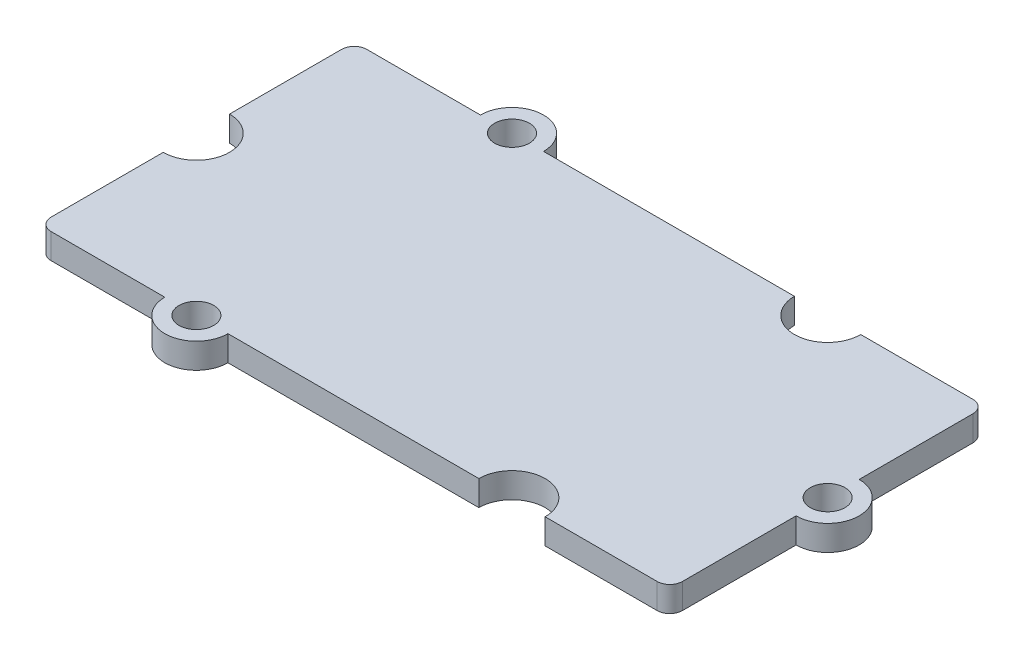
ISO-10303-21;
HEADER;
FILE_DESCRIPTION(('STEP AP214'),'2;1');
FILE_NAME('part.step','',(''),(''),'','','');
FILE_SCHEMA(('AUTOMOTIVE_DESIGN { 1 0 10303 214 1 1 1 1 }'));
ENDSEC;
DATA;
#1=APPLICATION_CONTEXT('core data for automotive mechanical design processes');
#2=APPLICATION_PROTOCOL_DEFINITION('international standard','automotive_design',2000,#1);
#3=PRODUCT_CONTEXT('',#1,'mechanical');
#4=PRODUCT('Part','Part','',(#3));
#5=PRODUCT_RELATED_PRODUCT_CATEGORY('part','',(#4));
#6=PRODUCT_DEFINITION_FORMATION('','',#4);
#7=PRODUCT_DEFINITION_CONTEXT('part definition',#1,'design');
#8=PRODUCT_DEFINITION('design','',#6,#7);
#9=PRODUCT_DEFINITION_SHAPE('','',#8);
#10=(LENGTH_UNIT() NAMED_UNIT(*) SI_UNIT(.MILLI.,.METRE.));
#11=(NAMED_UNIT(*) PLANE_ANGLE_UNIT() SI_UNIT($,.RADIAN.));
#12=(NAMED_UNIT(*) SI_UNIT($,.STERADIAN.) SOLID_ANGLE_UNIT());
#13=UNCERTAINTY_MEASURE_WITH_UNIT(LENGTH_MEASURE(1.E-05),#10,'distance_accuracy_value','');
#14=(GEOMETRIC_REPRESENTATION_CONTEXT(3) GLOBAL_UNCERTAINTY_ASSIGNED_CONTEXT((#13)) GLOBAL_UNIT_ASSIGNED_CONTEXT((#10,
#11,#12)) REPRESENTATION_CONTEXT('',''));
#15=CARTESIAN_POINT('',(0.,0.,0.));
#16=DIRECTION('',(0.,0.,1.));
#17=DIRECTION('',(1.,0.,0.));
#18=AXIS2_PLACEMENT_3D('',#15,#16,#17);
#19=CARTESIAN_POINT('',(20.,0.8,0.));
#20=DIRECTION('',(0.,-1.,0.));
#21=DIRECTION('',(0.,0.,-1.));
#22=AXIS2_PLACEMENT_3D('',#19,#20,#21);
#23=CYLINDRICAL_SURFACE('',#22,2.);
#24=CARTESIAN_POINT('',(20.,-0.8,0.));
#25=DIRECTION('',(0.,1.,0.));
#26=DIRECTION('',(0.,0.,1.));
#27=AXIS2_PLACEMENT_3D('',#24,#25,#26);
#28=CIRCLE('',#27,2.);
#29=CARTESIAN_POINT('',(20.,-0.8,2.00000000000001));
#30=VERTEX_POINT('',#29);
#31=CARTESIAN_POINT('',(20.,-0.8,-2.));
#32=VERTEX_POINT('',#31);
#33=EDGE_CURVE('E216',#30,#32,#28,.T.);
#34=ORIENTED_EDGE('',*,*,#33,.T.);
#35=DIRECTION('',(0.,-1.,0.));
#36=VECTOR('',#35,1.);
#37=CARTESIAN_POINT('',(20.,0.8,-2.));
#38=LINE('',#37,#36);
#39=CARTESIAN_POINT('',(20.,0.8,-2.));
#40=VERTEX_POINT('',#39);
#41=EDGE_CURVE('E11',#40,#32,#38,.T.);
#42=ORIENTED_EDGE('',*,*,#41,.F.);
#43=CARTESIAN_POINT('',(20.,0.8,0.));
#44=DIRECTION('',(0.,1.,0.));
#45=DIRECTION('',(0.,0.,1.));
#46=AXIS2_PLACEMENT_3D('',#43,#44,#45);
#47=CIRCLE('',#46,2.);
#48=CARTESIAN_POINT('',(20.,0.8,2.00000000000001));
#49=VERTEX_POINT('',#48);
#50=EDGE_CURVE('E267',#49,#40,#47,.T.);
#51=ORIENTED_EDGE('',*,*,#50,.F.);
#52=DIRECTION('',(0.,-1.,0.));
#53=VECTOR('',#52,1.);
#54=CARTESIAN_POINT('',(20.,0.8,2.00000000000001));
#55=LINE('',#54,#53);
#56=EDGE_CURVE('E215',#49,#30,#55,.T.);
#57=ORIENTED_EDGE('',*,*,#56,.T.);
#58=EDGE_LOOP('',(#34,#42,#51,#57));
#59=FACE_BOUND('',#58,.T.);
#60=ADVANCED_FACE('F36',(#59),#23,.T.);
#61=CARTESIAN_POINT('',(20.,0.8,0.));
#62=DIRECTION('',(-1.,0.,0.));
#63=DIRECTION('',(0.,0.,1.));
#64=AXIS2_PLACEMENT_3D('',#61,#62,#63);
#65=PLANE('',#64);
#66=DIRECTION('',(0.,0.,-1.));
#67=VECTOR('',#66,1.);
#68=CARTESIAN_POINT('',(20.,-0.8,0.));
#69=LINE('',#68,#67);
#70=CARTESIAN_POINT('',(20.,-0.8,-9.19999999999999));
#71=VERTEX_POINT('',#70);
#72=EDGE_CURVE('E219',#32,#71,#69,.T.);
#73=ORIENTED_EDGE('',*,*,#72,.T.);
#74=DIRECTION('',(0.,-1.,0.));
#75=VECTOR('',#74,1.);
#76=CARTESIAN_POINT('',(20.,0.8,-9.19999999999999));
#77=LINE('',#76,#75);
#78=CARTESIAN_POINT('',(20.,0.8,-9.19999999999999));
#79=VERTEX_POINT('',#78);
#80=EDGE_CURVE('E44',#79,#71,#77,.T.);
#81=ORIENTED_EDGE('',*,*,#80,.F.);
#82=DIRECTION('',(0.,0.,-1.));
#83=VECTOR('',#82,1.);
#84=CARTESIAN_POINT('',(20.,0.8,0.));
#85=LINE('',#84,#83);
#86=EDGE_CURVE('E131',#40,#79,#85,.T.);
#87=ORIENTED_EDGE('',*,*,#86,.F.);
#88=ORIENTED_EDGE('',*,*,#41,.T.);
#89=EDGE_LOOP('',(#73,#81,#87,#88));
#90=FACE_BOUND('',#89,.T.);
#91=ADVANCED_FACE('F306',(#90),#65,.F.);
#92=CARTESIAN_POINT('',(19.2,0.8,-9.19999999999999));
#93=DIRECTION('',(0.,-1.,0.));
#94=DIRECTION('',(0.,0.,-1.));
#95=AXIS2_PLACEMENT_3D('',#92,#93,#94);
#96=CYLINDRICAL_SURFACE('',#95,0.800000000000002);
#97=CARTESIAN_POINT('',(19.2,-0.8,-9.19999999999999));
#98=DIRECTION('',(0.,1.,0.));
#99=DIRECTION('',(0.,0.,1.));
#100=AXIS2_PLACEMENT_3D('',#97,#98,#99);
#101=CIRCLE('',#100,0.800000000000002);
#102=CARTESIAN_POINT('',(19.2,-0.8,-9.99999999999999));
#103=VERTEX_POINT('',#102);
#104=EDGE_CURVE('E222',#103,#71,#101,.F.);
#105=ORIENTED_EDGE('',*,*,#104,.F.);
#106=DIRECTION('',(0.,-1.,0.));
#107=VECTOR('',#106,1.);
#108=CARTESIAN_POINT('',(19.2,0.8,-9.99999999999999));
#109=LINE('',#108,#107);
#110=CARTESIAN_POINT('',(19.2,0.8,-9.99999999999999));
#111=VERTEX_POINT('',#110);
#112=EDGE_CURVE('E299',#111,#103,#109,.T.);
#113=ORIENTED_EDGE('',*,*,#112,.F.);
#114=CARTESIAN_POINT('',(19.2,0.8,-9.19999999999999));
#115=DIRECTION('',(0.,1.,0.));
#116=DIRECTION('',(0.,0.,1.));
#117=AXIS2_PLACEMENT_3D('',#114,#115,#116);
#118=CIRCLE('',#117,0.800000000000002);
#119=EDGE_CURVE('E305',#111,#79,#118,.F.);
#120=ORIENTED_EDGE('',*,*,#119,.T.);
#121=ORIENTED_EDGE('',*,*,#80,.T.);
#122=EDGE_LOOP('',(#105,#113,#120,#121));
#123=FACE_BOUND('',#122,.T.);
#124=ADVANCED_FACE('F303',(#123),#96,.T.);
#125=CARTESIAN_POINT('',(0.,0.8,-9.99999999999999));
#126=DIRECTION('',(0.,0.,-1.));
#127=DIRECTION('',(-1.,0.,0.));
#128=AXIS2_PLACEMENT_3D('',#125,#126,#127);
#129=PLANE('',#128);
#130=DIRECTION('',(1.,0.,0.));
#131=VECTOR('',#130,1.);
#132=CARTESIAN_POINT('',(0.,-0.8,-9.99999999999999));
#133=LINE('',#132,#131);
#134=CARTESIAN_POINT('',(12.1,-0.8,-9.99999999999999));
#135=VERTEX_POINT('',#134);
#136=EDGE_CURVE('E225',#135,#103,#133,.T.);
#137=ORIENTED_EDGE('',*,*,#136,.F.);
#138=DIRECTION('',(0.,-1.,0.));
#139=VECTOR('',#138,1.);
#140=CARTESIAN_POINT('',(12.1,0.8,-9.99999999999999));
#141=LINE('',#140,#139);
#142=CARTESIAN_POINT('',(12.1,0.8,-9.99999999999999));
#143=VERTEX_POINT('',#142);
#144=EDGE_CURVE('E297',#143,#135,#141,.T.);
#145=ORIENTED_EDGE('',*,*,#144,.F.);
#146=DIRECTION('',(1.,0.,0.));
#147=VECTOR('',#146,1.);
#148=CARTESIAN_POINT('',(0.,0.8,-9.99999999999999));
#149=LINE('',#148,#147);
#150=EDGE_CURVE('E319',#143,#111,#149,.T.);
#151=ORIENTED_EDGE('',*,*,#150,.T.);
#152=ORIENTED_EDGE('',*,*,#112,.T.);
#153=EDGE_LOOP('',(#137,#145,#151,#152));
#154=FACE_BOUND('',#153,.T.);
#155=ADVANCED_FACE('F316',(#154),#129,.T.);
#156=CARTESIAN_POINT('',(10.,0.8,-9.99999999999999));
#157=DIRECTION('',(0.,-1.,0.));
#158=DIRECTION('',(0.,0.,-1.));
#159=AXIS2_PLACEMENT_3D('',#156,#157,#158);
#160=CYLINDRICAL_SURFACE('',#159,2.1);
#161=CARTESIAN_POINT('',(10.,-0.8,-9.99999999999999));
#162=DIRECTION('',(0.,1.,0.));
#163=DIRECTION('',(0.,0.,1.));
#164=AXIS2_PLACEMENT_3D('',#161,#162,#163);
#165=CIRCLE('',#164,2.1);
#166=CARTESIAN_POINT('',(7.9,-0.8,-9.99999999999999));
#167=VERTEX_POINT('',#166);
#168=EDGE_CURVE('E228',#167,#135,#165,.T.);
#169=ORIENTED_EDGE('',*,*,#168,.F.);
#170=DIRECTION('',(0.,-1.,0.));
#171=VECTOR('',#170,1.);
#172=CARTESIAN_POINT('',(7.9,0.8,-9.99999999999999));
#173=LINE('',#172,#171);
#174=CARTESIAN_POINT('',(7.9,0.8,-9.99999999999999));
#175=VERTEX_POINT('',#174);
#176=EDGE_CURVE('E295',#175,#167,#173,.T.);
#177=ORIENTED_EDGE('',*,*,#176,.F.);
#178=CARTESIAN_POINT('',(10.,0.8,-9.99999999999999));
#179=DIRECTION('',(0.,1.,0.));
#180=DIRECTION('',(0.,0.,1.));
#181=AXIS2_PLACEMENT_3D('',#178,#179,#180);
#182=CIRCLE('',#181,2.1);
#183=EDGE_CURVE('E323',#175,#143,#182,.T.);
#184=ORIENTED_EDGE('',*,*,#183,.T.);
#185=ORIENTED_EDGE('',*,*,#144,.T.);
#186=EDGE_LOOP('',(#169,#177,#184,#185));
#187=FACE_BOUND('',#186,.T.);
#188=ADVANCED_FACE('F401',(#187),#160,.F.);
#189=CARTESIAN_POINT('',(-8.,-0.8,-9.99999999999999));
#190=VERTEX_POINT('',#189);
#191=EDGE_CURVE('E230',#190,#167,#133,.T.);
#192=ORIENTED_EDGE('',*,*,#191,.F.);
#193=DIRECTION('',(0.,-1.,0.));
#194=VECTOR('',#193,1.);
#195=CARTESIAN_POINT('',(-8.,0.8,-9.99999999999999));
#196=LINE('',#195,#194);
#197=CARTESIAN_POINT('',(-8.,0.8,-9.99999999999999));
#198=VERTEX_POINT('',#197);
#199=EDGE_CURVE('E293',#198,#190,#196,.T.);
#200=ORIENTED_EDGE('',*,*,#199,.F.);
#201=EDGE_CURVE('E326',#198,#175,#149,.T.);
#202=ORIENTED_EDGE('',*,*,#201,.T.);
#203=ORIENTED_EDGE('',*,*,#176,.T.);
#204=EDGE_LOOP('',(#192,#200,#202,#203));
#205=FACE_BOUND('',#204,.T.);
#206=ADVANCED_FACE('F396',(#205),#129,.T.);
#207=CARTESIAN_POINT('',(-10.,0.8,-9.99999999999999));
#208=DIRECTION('',(0.,-1.,0.));
#209=DIRECTION('',(0.,0.,-1.));
#210=AXIS2_PLACEMENT_3D('',#207,#208,#209);
#211=CYLINDRICAL_SURFACE('',#210,2.);
#212=CARTESIAN_POINT('',(-10.,-0.8,-9.99999999999999));
#213=DIRECTION('',(0.,1.,0.));
#214=DIRECTION('',(0.,0.,1.));
#215=AXIS2_PLACEMENT_3D('',#212,#213,#214);
#216=CIRCLE('',#215,2.);
#217=CARTESIAN_POINT('',(-12.,-0.8,-9.99999999999999));
#218=VERTEX_POINT('',#217);
#219=EDGE_CURVE('E233',#190,#218,#216,.T.);
#220=ORIENTED_EDGE('',*,*,#219,.T.);
#221=DIRECTION('',(0.,-1.,0.));
#222=VECTOR('',#221,1.);
#223=CARTESIAN_POINT('',(-12.,0.8,-9.99999999999999));
#224=LINE('',#223,#222);
#225=CARTESIAN_POINT('',(-12.,0.8,-9.99999999999999));
#226=VERTEX_POINT('',#225);
#227=EDGE_CURVE('E291',#226,#218,#224,.T.);
#228=ORIENTED_EDGE('',*,*,#227,.F.);
#229=CARTESIAN_POINT('',(-10.,0.8,-9.99999999999999));
#230=DIRECTION('',(0.,1.,0.));
#231=DIRECTION('',(0.,0.,1.));
#232=AXIS2_PLACEMENT_3D('',#229,#230,#231);
#233=CIRCLE('',#232,2.);
#234=EDGE_CURVE('E330',#198,#226,#233,.T.);
#235=ORIENTED_EDGE('',*,*,#234,.F.);
#236=ORIENTED_EDGE('',*,*,#199,.T.);
#237=EDGE_LOOP('',(#220,#228,#235,#236));
#238=FACE_BOUND('',#237,.T.);
#239=ADVANCED_FACE('F403',(#238),#211,.T.);
#240=CARTESIAN_POINT('',(-19.2,-0.8,-9.99999999999999));
#241=VERTEX_POINT('',#240);
#242=EDGE_CURVE('E229',#241,#218,#133,.T.);
#243=ORIENTED_EDGE('',*,*,#242,.F.);
#244=DIRECTION('',(0.,-1.,0.));
#245=VECTOR('',#244,1.);
#246=CARTESIAN_POINT('',(-19.2,0.8,-9.99999999999999));
#247=LINE('',#246,#245);
#248=CARTESIAN_POINT('',(-19.2,0.8,-9.99999999999999));
#249=VERTEX_POINT('',#248);
#250=EDGE_CURVE('E289',#249,#241,#247,.T.);
#251=ORIENTED_EDGE('',*,*,#250,.F.);
#252=EDGE_CURVE('E325',#249,#226,#149,.T.);
#253=ORIENTED_EDGE('',*,*,#252,.T.);
#254=ORIENTED_EDGE('',*,*,#227,.T.);
#255=EDGE_LOOP('',(#243,#251,#253,#254));
#256=FACE_BOUND('',#255,.T.);
#257=ADVANCED_FACE('F392',(#256),#129,.T.);
#258=CARTESIAN_POINT('',(-19.2,0.8,-9.19999999999999));
#259=DIRECTION('',(0.,-1.,0.));
#260=DIRECTION('',(0.,0.,-1.));
#261=AXIS2_PLACEMENT_3D('',#258,#259,#260);
#262=CYLINDRICAL_SURFACE('',#261,0.8);
#263=CARTESIAN_POINT('',(-19.2,-0.8,-9.19999999999999));
#264=DIRECTION('',(0.,1.,0.));
#265=DIRECTION('',(0.,0.,1.));
#266=AXIS2_PLACEMENT_3D('',#263,#264,#265);
#267=CIRCLE('',#266,0.8);
#268=CARTESIAN_POINT('',(-20.,-0.8,-9.19999999999999));
#269=VERTEX_POINT('',#268);
#270=EDGE_CURVE('E236',#269,#241,#267,.F.);
#271=ORIENTED_EDGE('',*,*,#270,.F.);
#272=DIRECTION('',(0.,-1.,0.));
#273=VECTOR('',#272,1.);
#274=CARTESIAN_POINT('',(-20.,0.8,-9.19999999999999));
#275=LINE('',#274,#273);
#276=CARTESIAN_POINT('',(-20.,0.8,-9.19999999999999));
#277=VERTEX_POINT('',#276);
#278=EDGE_CURVE('E287',#277,#269,#275,.T.);
#279=ORIENTED_EDGE('',*,*,#278,.F.);
#280=CARTESIAN_POINT('',(-19.2,0.8,-9.19999999999999));
#281=DIRECTION('',(0.,1.,0.));
#282=DIRECTION('',(0.,0.,1.));
#283=AXIS2_PLACEMENT_3D('',#280,#281,#282);
#284=CIRCLE('',#283,0.8);
#285=EDGE_CURVE('E332',#277,#249,#284,.F.);
#286=ORIENTED_EDGE('',*,*,#285,.T.);
#287=ORIENTED_EDGE('',*,*,#250,.T.);
#288=EDGE_LOOP('',(#271,#279,#286,#287));
#289=FACE_BOUND('',#288,.T.);
#290=ADVANCED_FACE('F387',(#289),#262,.T.);
#291=CARTESIAN_POINT('',(-20.,0.8,0.));
#292=DIRECTION('',(-1.,0.,0.));
#293=DIRECTION('',(0.,0.,1.));
#294=AXIS2_PLACEMENT_3D('',#291,#292,#293);
#295=PLANE('',#294);
#296=DIRECTION('',(0.,0.,-1.));
#297=VECTOR('',#296,1.);
#298=CARTESIAN_POINT('',(-20.,-0.8,0.));
#299=LINE('',#298,#297);
#300=CARTESIAN_POINT('',(-20.,-0.8,-2.09999999999999));
#301=VERTEX_POINT('',#300);
#302=EDGE_CURVE('E239',#301,#269,#299,.T.);
#303=ORIENTED_EDGE('',*,*,#302,.F.);
#304=DIRECTION('',(0.,-1.,0.));
#305=VECTOR('',#304,1.);
#306=CARTESIAN_POINT('',(-20.,0.8,-2.09999999999999));
#307=LINE('',#306,#305);
#308=CARTESIAN_POINT('',(-20.,0.8,-2.09999999999999));
#309=VERTEX_POINT('',#308);
#310=EDGE_CURVE('E285',#309,#301,#307,.T.);
#311=ORIENTED_EDGE('',*,*,#310,.F.);
#312=DIRECTION('',(0.,0.,-1.));
#313=VECTOR('',#312,1.);
#314=CARTESIAN_POINT('',(-20.,0.8,0.));
#315=LINE('',#314,#313);
#316=EDGE_CURVE('E335',#309,#277,#315,.T.);
#317=ORIENTED_EDGE('',*,*,#316,.T.);
#318=ORIENTED_EDGE('',*,*,#278,.T.);
#319=EDGE_LOOP('',(#303,#311,#317,#318));
#320=FACE_BOUND('',#319,.T.);
#321=ADVANCED_FACE('F381',(#320),#295,.T.);
#322=CARTESIAN_POINT('',(-20.,0.8,0.));
#323=DIRECTION('',(0.,-1.,0.));
#324=DIRECTION('',(0.,0.,-1.));
#325=AXIS2_PLACEMENT_3D('',#322,#323,#324);
#326=CYLINDRICAL_SURFACE('',#325,2.1);
#327=CARTESIAN_POINT('',(-20.,-0.8,0.));
#328=DIRECTION('',(0.,1.,0.));
#329=DIRECTION('',(0.,0.,1.));
#330=AXIS2_PLACEMENT_3D('',#327,#328,#329);
#331=CIRCLE('',#330,2.1);
#332=CARTESIAN_POINT('',(-20.,-0.8,2.10000000000001));
#333=VERTEX_POINT('',#332);
#334=EDGE_CURVE('E242',#333,#301,#331,.T.);
#335=ORIENTED_EDGE('',*,*,#334,.F.);
#336=DIRECTION('',(0.,-1.,0.));
#337=VECTOR('',#336,1.);
#338=CARTESIAN_POINT('',(-20.,0.8,2.10000000000001));
#339=LINE('',#338,#337);
#340=CARTESIAN_POINT('',(-20.,0.8,2.10000000000001));
#341=VERTEX_POINT('',#340);
#342=EDGE_CURVE('E283',#341,#333,#339,.T.);
#343=ORIENTED_EDGE('',*,*,#342,.F.);
#344=CARTESIAN_POINT('',(-20.,0.8,0.));
#345=DIRECTION('',(0.,1.,0.));
#346=DIRECTION('',(0.,0.,1.));
#347=AXIS2_PLACEMENT_3D('',#344,#345,#346);
#348=CIRCLE('',#347,2.1);
#349=EDGE_CURVE('E338',#341,#309,#348,.T.);
#350=ORIENTED_EDGE('',*,*,#349,.T.);
#351=ORIENTED_EDGE('',*,*,#310,.T.);
#352=EDGE_LOOP('',(#335,#343,#350,#351));
#353=FACE_BOUND('',#352,.T.);
#354=ADVANCED_FACE('F377',(#353),#326,.F.);
#355=CARTESIAN_POINT('',(-20.,-0.8,9.20000000000001));
#356=VERTEX_POINT('',#355);
#357=EDGE_CURVE('E243',#356,#333,#299,.T.);
#358=ORIENTED_EDGE('',*,*,#357,.F.);
#359=DIRECTION('',(0.,-1.,0.));
#360=VECTOR('',#359,1.);
#361=CARTESIAN_POINT('',(-20.,0.8,9.20000000000001));
#362=LINE('',#361,#360);
#363=CARTESIAN_POINT('',(-20.,0.8,9.20000000000001));
#364=VERTEX_POINT('',#363);
#365=EDGE_CURVE('E281',#364,#356,#362,.T.);
#366=ORIENTED_EDGE('',*,*,#365,.F.);
#367=EDGE_CURVE('E339',#364,#341,#315,.T.);
#368=ORIENTED_EDGE('',*,*,#367,.T.);
#369=ORIENTED_EDGE('',*,*,#342,.T.);
#370=EDGE_LOOP('',(#358,#366,#368,#369));
#371=FACE_BOUND('',#370,.T.);
#372=ADVANCED_FACE('F372',(#371),#295,.T.);
#373=CARTESIAN_POINT('',(-19.2,0.8,9.20000000000001));
#374=DIRECTION('',(0.,-1.,0.));
#375=DIRECTION('',(0.,0.,-1.));
#376=AXIS2_PLACEMENT_3D('',#373,#374,#375);
#377=CYLINDRICAL_SURFACE('',#376,0.8);
#378=CARTESIAN_POINT('',(-19.2,-0.8,9.20000000000001));
#379=DIRECTION('',(0.,1.,0.));
#380=DIRECTION('',(0.,0.,1.));
#381=AXIS2_PLACEMENT_3D('',#378,#379,#380);
#382=CIRCLE('',#381,0.8);
#383=CARTESIAN_POINT('',(-19.2,-0.8,10.));
#384=VERTEX_POINT('',#383);
#385=EDGE_CURVE('E246',#384,#356,#382,.F.);
#386=ORIENTED_EDGE('',*,*,#385,.F.);
#387=DIRECTION('',(0.,-1.,0.));
#388=VECTOR('',#387,1.);
#389=CARTESIAN_POINT('',(-19.2,0.8,10.));
#390=LINE('',#389,#388);
#391=CARTESIAN_POINT('',(-19.2,0.8,10.));
#392=VERTEX_POINT('',#391);
#393=EDGE_CURVE('E279',#392,#384,#390,.T.);
#394=ORIENTED_EDGE('',*,*,#393,.F.);
#395=CARTESIAN_POINT('',(-19.2,0.8,9.20000000000001));
#396=DIRECTION('',(0.,1.,0.));
#397=DIRECTION('',(0.,0.,1.));
#398=AXIS2_PLACEMENT_3D('',#395,#396,#397);
#399=CIRCLE('',#398,0.8);
#400=EDGE_CURVE('E342',#392,#364,#399,.F.);
#401=ORIENTED_EDGE('',*,*,#400,.T.);
#402=ORIENTED_EDGE('',*,*,#365,.T.);
#403=EDGE_LOOP('',(#386,#394,#401,#402));
#404=FACE_BOUND('',#403,.T.);
#405=ADVANCED_FACE('F367',(#404),#377,.T.);
#406=CARTESIAN_POINT('',(0.,0.8,10.));
#407=DIRECTION('',(0.,0.,-1.));
#408=DIRECTION('',(-1.,0.,0.));
#409=AXIS2_PLACEMENT_3D('',#406,#407,#408);
#410=PLANE('',#409);
#411=DIRECTION('',(1.,0.,0.));
#412=VECTOR('',#411,1.);
#413=CARTESIAN_POINT('',(0.,-0.8,10.));
#414=LINE('',#413,#412);
#415=CARTESIAN_POINT('',(-12.,-0.8,10.));
#416=VERTEX_POINT('',#415);
#417=EDGE_CURVE('E249',#384,#416,#414,.T.);
#418=ORIENTED_EDGE('',*,*,#417,.T.);
#419=DIRECTION('',(0.,-1.,0.));
#420=VECTOR('',#419,1.);
#421=CARTESIAN_POINT('',(-12.,0.8,10.));
#422=LINE('',#421,#420);
#423=CARTESIAN_POINT('',(-12.,0.8,10.));
#424=VERTEX_POINT('',#423);
#425=EDGE_CURVE('E276',#424,#416,#422,.T.);
#426=ORIENTED_EDGE('',*,*,#425,.F.);
#427=DIRECTION('',(1.,0.,0.));
#428=VECTOR('',#427,1.);
#429=CARTESIAN_POINT('',(0.,0.8,10.));
#430=LINE('',#429,#428);
#431=EDGE_CURVE('E192',#392,#424,#430,.T.);
#432=ORIENTED_EDGE('',*,*,#431,.F.);
#433=ORIENTED_EDGE('',*,*,#393,.T.);
#434=EDGE_LOOP('',(#418,#426,#432,#433));
#435=FACE_BOUND('',#434,.T.);
#436=ADVANCED_FACE('F364',(#435),#410,.F.);
#437=CARTESIAN_POINT('',(-10.,0.8,10.));
#438=DIRECTION('',(0.,-1.,0.));
#439=DIRECTION('',(0.,0.,-1.));
#440=AXIS2_PLACEMENT_3D('',#437,#438,#439);
#441=CYLINDRICAL_SURFACE('',#440,2.);
#442=CARTESIAN_POINT('',(-10.,-0.8,10.));
#443=DIRECTION('',(0.,1.,0.));
#444=DIRECTION('',(0.,0.,1.));
#445=AXIS2_PLACEMENT_3D('',#442,#443,#444);
#446=CIRCLE('',#445,2.);
#447=CARTESIAN_POINT('',(-8.,-0.8,10.));
#448=VERTEX_POINT('',#447);
#449=EDGE_CURVE('E251',#416,#448,#446,.T.);
#450=ORIENTED_EDGE('',*,*,#449,.T.);
#451=DIRECTION('',(0.,-1.,0.));
#452=VECTOR('',#451,1.);
#453=CARTESIAN_POINT('',(-8.,0.8,10.));
#454=LINE('',#453,#452);
#455=CARTESIAN_POINT('',(-8.,0.8,10.));
#456=VERTEX_POINT('',#455);
#457=EDGE_CURVE('E273',#456,#448,#454,.T.);
#458=ORIENTED_EDGE('',*,*,#457,.F.);
#459=CARTESIAN_POINT('',(-10.,0.8,10.));
#460=DIRECTION('',(0.,1.,0.));
#461=DIRECTION('',(0.,0.,1.));
#462=AXIS2_PLACEMENT_3D('',#459,#460,#461);
#463=CIRCLE('',#462,2.);
#464=EDGE_CURVE('E344',#424,#456,#463,.T.);
#465=ORIENTED_EDGE('',*,*,#464,.F.);
#466=ORIENTED_EDGE('',*,*,#425,.T.);
#467=EDGE_LOOP('',(#450,#458,#465,#466));
#468=FACE_BOUND('',#467,.T.);
#469=ADVANCED_FACE('F360',(#468),#441,.T.);
#470=CARTESIAN_POINT('',(7.9,-0.8,10.));
#471=VERTEX_POINT('',#470);
#472=EDGE_CURVE('E252',#448,#471,#414,.T.);
#473=ORIENTED_EDGE('',*,*,#472,.T.);
#474=DIRECTION('',(0.,-1.,0.));
#475=VECTOR('',#474,1.);
#476=CARTESIAN_POINT('',(7.9,0.8,10.));
#477=LINE('',#476,#475);
#478=CARTESIAN_POINT('',(7.9,0.8,10.));
#479=VERTEX_POINT('',#478);
#480=EDGE_CURVE('E271',#479,#471,#477,.T.);
#481=ORIENTED_EDGE('',*,*,#480,.F.);
#482=EDGE_CURVE('E191',#456,#479,#430,.T.);
#483=ORIENTED_EDGE('',*,*,#482,.F.);
#484=ORIENTED_EDGE('',*,*,#457,.T.);
#485=EDGE_LOOP('',(#473,#481,#483,#484));
#486=FACE_BOUND('',#485,.T.);
#487=ADVANCED_FACE('F355',(#486),#410,.F.);
#488=CARTESIAN_POINT('',(10.,0.8,10.));
#489=DIRECTION('',(0.,-1.,0.));
#490=DIRECTION('',(0.,0.,-1.));
#491=AXIS2_PLACEMENT_3D('',#488,#489,#490);
#492=CYLINDRICAL_SURFACE('',#491,2.1);
#493=CARTESIAN_POINT('',(10.,-0.8,10.));
#494=DIRECTION('',(0.,1.,0.));
#495=DIRECTION('',(0.,0.,1.));
#496=AXIS2_PLACEMENT_3D('',#493,#494,#495);
#497=CIRCLE('',#496,2.1);
#498=CARTESIAN_POINT('',(12.1,-0.8,10.));
#499=VERTEX_POINT('',#498);
#500=EDGE_CURVE('E254',#499,#471,#497,.T.);
#501=ORIENTED_EDGE('',*,*,#500,.F.);
#502=DIRECTION('',(0.,-1.,0.));
#503=VECTOR('',#502,1.);
#504=CARTESIAN_POINT('',(12.1,0.8,10.));
#505=LINE('',#504,#503);
#506=CARTESIAN_POINT('',(12.1,0.8,10.));
#507=VERTEX_POINT('',#506);
#508=EDGE_CURVE('E197',#507,#499,#505,.T.);
#509=ORIENTED_EDGE('',*,*,#508,.F.);
#510=CARTESIAN_POINT('',(10.,0.8,10.));
#511=DIRECTION('',(0.,1.,0.));
#512=DIRECTION('',(0.,0.,1.));
#513=AXIS2_PLACEMENT_3D('',#510,#511,#512);
#514=CIRCLE('',#513,2.1);
#515=EDGE_CURVE('E188',#507,#479,#514,.T.);
#516=ORIENTED_EDGE('',*,*,#515,.T.);
#517=ORIENTED_EDGE('',*,*,#480,.T.);
#518=EDGE_LOOP('',(#501,#509,#516,#517));
#519=FACE_BOUND('',#518,.T.);
#520=ADVANCED_FACE('F351',(#519),#492,.F.);
#521=CARTESIAN_POINT('',(19.2,-0.8,10.));
#522=VERTEX_POINT('',#521);
#523=EDGE_CURVE('E196',#499,#522,#414,.T.);
#524=ORIENTED_EDGE('',*,*,#523,.T.);
#525=DIRECTION('',(0.,-1.,0.));
#526=VECTOR('',#525,1.);
#527=CARTESIAN_POINT('',(19.2,0.8,10.));
#528=LINE('',#527,#526);
#529=CARTESIAN_POINT('',(19.2,0.8,10.));
#530=VERTEX_POINT('',#529);
#531=EDGE_CURVE('E193',#530,#522,#528,.T.);
#532=ORIENTED_EDGE('',*,*,#531,.F.);
#533=EDGE_CURVE('E181',#507,#530,#430,.T.);
#534=ORIENTED_EDGE('',*,*,#533,.F.);
#535=ORIENTED_EDGE('',*,*,#508,.T.);
#536=EDGE_LOOP('',(#524,#532,#534,#535));
#537=FACE_BOUND('',#536,.T.);
#538=ADVANCED_FACE('F194',(#537),#410,.F.);
#539=CARTESIAN_POINT('',(19.2,0.8,9.20000000000001));
#540=DIRECTION('',(0.,-1.,0.));
#541=DIRECTION('',(0.,0.,-1.));
#542=AXIS2_PLACEMENT_3D('',#539,#540,#541);
#543=CYLINDRICAL_SURFACE('',#542,0.8);
#544=CARTESIAN_POINT('',(19.2,-0.8,9.20000000000001));
#545=DIRECTION('',(0.,1.,0.));
#546=DIRECTION('',(0.,0.,1.));
#547=AXIS2_PLACEMENT_3D('',#544,#545,#546);
#548=CIRCLE('',#547,0.8);
#549=CARTESIAN_POINT('',(20.,-0.8,9.20000000000001));
#550=VERTEX_POINT('',#549);
#551=EDGE_CURVE('E117',#522,#550,#548,.T.);
#552=ORIENTED_EDGE('',*,*,#551,.T.);
#553=DIRECTION('',(0.,-1.,0.));
#554=VECTOR('',#553,1.);
#555=CARTESIAN_POINT('',(20.,0.8,9.20000000000001));
#556=LINE('',#555,#554);
#557=CARTESIAN_POINT('',(20.,0.8,9.20000000000001));
#558=VERTEX_POINT('',#557);
#559=EDGE_CURVE('E198',#558,#550,#556,.T.);
#560=ORIENTED_EDGE('',*,*,#559,.F.);
#561=CARTESIAN_POINT('',(19.2,0.8,9.20000000000001));
#562=DIRECTION('',(0.,1.,0.));
#563=DIRECTION('',(0.,0.,1.));
#564=AXIS2_PLACEMENT_3D('',#561,#562,#563);
#565=CIRCLE('',#564,0.8);
#566=EDGE_CURVE('E186',#530,#558,#565,.T.);
#567=ORIENTED_EDGE('',*,*,#566,.F.);
#568=ORIENTED_EDGE('',*,*,#531,.T.);
#569=EDGE_LOOP('',(#552,#560,#567,#568));
#570=FACE_BOUND('',#569,.T.);
#571=ADVANCED_FACE('F200',(#570),#543,.T.);
#572=CARTESIAN_POINT('',(20.,0.8,0.));
#573=DIRECTION('',(0.,-1.,0.));
#574=DIRECTION('',(0.,0.,-1.));
#575=AXIS2_PLACEMENT_3D('',#572,#573,#574);
#576=CYLINDRICAL_SURFACE('',#575,1.1);
#577=CARTESIAN_POINT('',(20.,0.8,0.));
#578=DIRECTION('',(0.,1.,0.));
#579=DIRECTION('',(0.,0.,1.));
#580=AXIS2_PLACEMENT_3D('',#577,#578,#579);
#581=CIRCLE('',#580,1.1);
#582=CARTESIAN_POINT('',(20.,0.8,1.1));
#583=VERTEX_POINT('',#582);
#584=EDGE_CURVE('E209',#583,#583,#581,.T.);
#585=ORIENTED_EDGE('',*,*,#584,.T.);
#586=EDGE_LOOP('',(#585));
#587=FACE_BOUND('',#586,.T.);
#588=CARTESIAN_POINT('',(20.,-0.8,0.));
#589=DIRECTION('',(0.,1.,0.));
#590=DIRECTION('',(0.,0.,1.));
#591=AXIS2_PLACEMENT_3D('',#588,#589,#590);
#592=CIRCLE('',#591,1.1);
#593=CARTESIAN_POINT('',(20.,-0.8,1.1));
#594=VERTEX_POINT('',#593);
#595=EDGE_CURVE('E261',#594,#594,#592,.T.);
#596=ORIENTED_EDGE('',*,*,#595,.F.);
#597=EDGE_LOOP('',(#596));
#598=FACE_BOUND('',#597,.T.);
#599=ADVANCED_FACE('F429',(#587,#598),#576,.F.);
#600=CARTESIAN_POINT('',(-10.,0.8,-9.99999999999999));
#601=DIRECTION('',(0.,-1.,0.));
#602=DIRECTION('',(0.,0.,-1.));
#603=AXIS2_PLACEMENT_3D('',#600,#601,#602);
#604=CYLINDRICAL_SURFACE('',#603,1.1);
#605=CARTESIAN_POINT('',(-10.,0.8,-9.99999999999999));
#606=DIRECTION('',(0.,1.,0.));
#607=DIRECTION('',(0.,0.,1.));
#608=AXIS2_PLACEMENT_3D('',#605,#606,#607);
#609=CIRCLE('',#608,1.1);
#610=CARTESIAN_POINT('',(-10.,0.8,-8.89999999999999));
#611=VERTEX_POINT('',#610);
#612=EDGE_CURVE('E202',#611,#611,#609,.T.);
#613=ORIENTED_EDGE('',*,*,#612,.T.);
#614=EDGE_LOOP('',(#613));
#615=FACE_BOUND('',#614,.T.);
#616=CARTESIAN_POINT('',(-10.,-0.8,-9.99999999999999));
#617=DIRECTION('',(0.,1.,0.));
#618=DIRECTION('',(0.,0.,1.));
#619=AXIS2_PLACEMENT_3D('',#616,#617,#618);
#620=CIRCLE('',#619,1.1);
#621=CARTESIAN_POINT('',(-10.,-0.8,-8.89999999999999));
#622=VERTEX_POINT('',#621);
#623=EDGE_CURVE('E258',#622,#622,#620,.T.);
#624=ORIENTED_EDGE('',*,*,#623,.F.);
#625=EDGE_LOOP('',(#624));
#626=FACE_BOUND('',#625,.T.);
#627=ADVANCED_FACE('F422',(#615,#626),#604,.F.);
#628=EDGE_CURVE('E123',#550,#30,#69,.T.);
#629=ORIENTED_EDGE('',*,*,#628,.T.);
#630=ORIENTED_EDGE('',*,*,#56,.F.);
#631=EDGE_CURVE('E52',#558,#49,#85,.T.);
#632=ORIENTED_EDGE('',*,*,#631,.F.);
#633=ORIENTED_EDGE('',*,*,#559,.T.);
#634=EDGE_LOOP('',(#629,#630,#632,#633));
#635=FACE_BOUND('',#634,.T.);
#636=ADVANCED_FACE('F418',(#635),#65,.F.);
#637=CARTESIAN_POINT('',(-10.,0.8,10.));
#638=DIRECTION('',(0.,-1.,0.));
#639=DIRECTION('',(0.,0.,-1.));
#640=AXIS2_PLACEMENT_3D('',#637,#638,#639);
#641=CYLINDRICAL_SURFACE('',#640,1.1);
#642=CARTESIAN_POINT('',(-10.,0.8,10.));
#643=DIRECTION('',(0.,1.,0.));
#644=DIRECTION('',(0.,0.,1.));
#645=AXIS2_PLACEMENT_3D('',#642,#643,#644);
#646=CIRCLE('',#645,1.1);
#647=CARTESIAN_POINT('',(-10.,0.8,11.1));
#648=VERTEX_POINT('',#647);
#649=EDGE_CURVE('E212',#648,#648,#646,.T.);
#650=ORIENTED_EDGE('',*,*,#649,.T.);
#651=EDGE_LOOP('',(#650));
#652=FACE_BOUND('',#651,.T.);
#653=CARTESIAN_POINT('',(-10.,-0.8,10.));
#654=DIRECTION('',(0.,1.,0.));
#655=DIRECTION('',(0.,0.,1.));
#656=AXIS2_PLACEMENT_3D('',#653,#654,#655);
#657=CIRCLE('',#656,1.1);
#658=CARTESIAN_POINT('',(-10.,-0.8,11.1));
#659=VERTEX_POINT('',#658);
#660=EDGE_CURVE('E264',#659,#659,#657,.T.);
#661=ORIENTED_EDGE('',*,*,#660,.F.);
#662=EDGE_LOOP('',(#661));
#663=FACE_BOUND('',#662,.T.);
#664=ADVANCED_FACE('F421',(#652,#663),#641,.F.);
#665=CARTESIAN_POINT('',(0.,0.8,0.));
#666=DIRECTION('',(0.,1.,0.));
#667=DIRECTION('',(0.,0.,1.));
#668=AXIS2_PLACEMENT_3D('',#665,#666,#667);
#669=PLANE('',#668);
#670=ORIENTED_EDGE('',*,*,#50,.T.);
#671=ORIENTED_EDGE('',*,*,#86,.T.);
#672=ORIENTED_EDGE('',*,*,#119,.F.);
#673=ORIENTED_EDGE('',*,*,#150,.F.);
#674=ORIENTED_EDGE('',*,*,#183,.F.);
#675=ORIENTED_EDGE('',*,*,#201,.F.);
#676=ORIENTED_EDGE('',*,*,#234,.T.);
#677=ORIENTED_EDGE('',*,*,#252,.F.);
#678=ORIENTED_EDGE('',*,*,#285,.F.);
#679=ORIENTED_EDGE('',*,*,#316,.F.);
#680=ORIENTED_EDGE('',*,*,#349,.F.);
#681=ORIENTED_EDGE('',*,*,#367,.F.);
#682=ORIENTED_EDGE('',*,*,#400,.F.);
#683=ORIENTED_EDGE('',*,*,#431,.T.);
#684=ORIENTED_EDGE('',*,*,#464,.T.);
#685=ORIENTED_EDGE('',*,*,#482,.T.);
#686=ORIENTED_EDGE('',*,*,#515,.F.);
#687=ORIENTED_EDGE('',*,*,#533,.T.);
#688=ORIENTED_EDGE('',*,*,#566,.T.);
#689=ORIENTED_EDGE('',*,*,#631,.T.);
#690=EDGE_LOOP('',(#670,#671,#672,#673,#674,#675,#676,#677,#678,#679,#680,#681,#682,#683,#684,
#685,#686,#687,#688,#689));
#691=FACE_BOUND('',#690,.T.);
#692=ORIENTED_EDGE('',*,*,#612,.F.);
#693=EDGE_LOOP('',(#692));
#694=FACE_BOUND('',#693,.T.);
#695=ORIENTED_EDGE('',*,*,#584,.F.);
#696=EDGE_LOOP('',(#695));
#697=FACE_BOUND('',#696,.T.);
#698=ORIENTED_EDGE('',*,*,#649,.F.);
#699=EDGE_LOOP('',(#698));
#700=FACE_BOUND('',#699,.T.);
#701=ADVANCED_FACE('F183',(#691,#694,#697,#700),#669,.T.);
#702=CARTESIAN_POINT('',(0.,-0.8,0.));
#703=DIRECTION('',(0.,1.,0.));
#704=DIRECTION('',(0.,0.,1.));
#705=AXIS2_PLACEMENT_3D('',#702,#703,#704);
#706=PLANE('',#705);
#707=ORIENTED_EDGE('',*,*,#33,.F.);
#708=ORIENTED_EDGE('',*,*,#628,.F.);
#709=ORIENTED_EDGE('',*,*,#551,.F.);
#710=ORIENTED_EDGE('',*,*,#523,.F.);
#711=ORIENTED_EDGE('',*,*,#500,.T.);
#712=ORIENTED_EDGE('',*,*,#472,.F.);
#713=ORIENTED_EDGE('',*,*,#449,.F.);
#714=ORIENTED_EDGE('',*,*,#417,.F.);
#715=ORIENTED_EDGE('',*,*,#385,.T.);
#716=ORIENTED_EDGE('',*,*,#357,.T.);
#717=ORIENTED_EDGE('',*,*,#334,.T.);
#718=ORIENTED_EDGE('',*,*,#302,.T.);
#719=ORIENTED_EDGE('',*,*,#270,.T.);
#720=ORIENTED_EDGE('',*,*,#242,.T.);
#721=ORIENTED_EDGE('',*,*,#219,.F.);
#722=ORIENTED_EDGE('',*,*,#191,.T.);
#723=ORIENTED_EDGE('',*,*,#168,.T.);
#724=ORIENTED_EDGE('',*,*,#136,.T.);
#725=ORIENTED_EDGE('',*,*,#104,.T.);
#726=ORIENTED_EDGE('',*,*,#72,.F.);
#727=EDGE_LOOP('',(#707,#708,#709,#710,#711,#712,#713,#714,#715,#716,#717,#718,#719,#720,#721,
#722,#723,#724,#725,#726));
#728=FACE_BOUND('',#727,.T.);
#729=ORIENTED_EDGE('',*,*,#623,.T.);
#730=EDGE_LOOP('',(#729));
#731=FACE_BOUND('',#730,.T.);
#732=ORIENTED_EDGE('',*,*,#595,.T.);
#733=EDGE_LOOP('',(#732));
#734=FACE_BOUND('',#733,.T.);
#735=ORIENTED_EDGE('',*,*,#660,.T.);
#736=EDGE_LOOP('',(#735));
#737=FACE_BOUND('',#736,.T.);
#738=ADVANCED_FACE('F310',(#728,#731,#734,#737),#706,.F.);
#739=CLOSED_SHELL('',(#60,#91,#124,#155,#188,#206,#239,#257,#290,#321,#354,#372,#405,#436,#469,
#487,#520,#538,#571,#599,#627,#636,#664,#701,#738));
#740=MANIFOLD_SOLID_BREP('B2',#739);
#741=ADVANCED_BREP_SHAPE_REPRESENTATION('',(#18,#740),#14);
#742=SHAPE_DEFINITION_REPRESENTATION(#9,#741);
ENDSEC;
END-ISO-10303-21;
